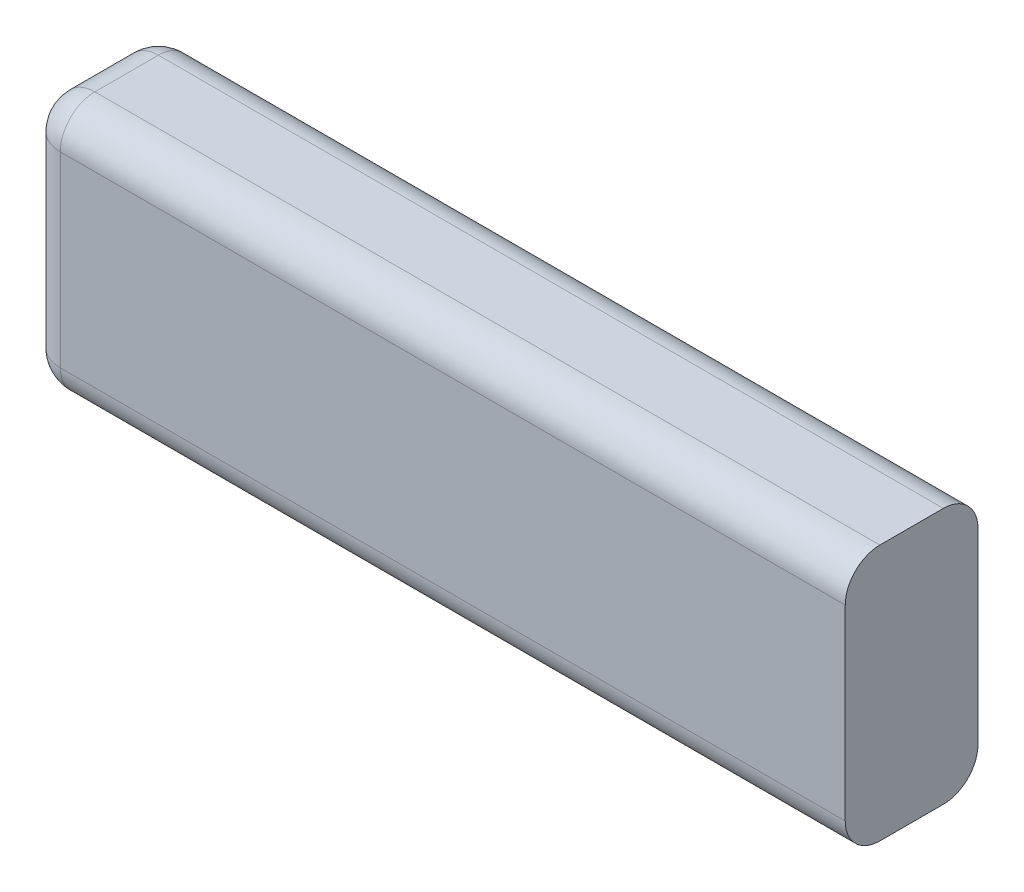
ISO-10303-21;
HEADER;
FILE_DESCRIPTION(('STEP AP214'),'2;1');
FILE_NAME('part.step','',(''),(''),'','','');
FILE_SCHEMA(('AUTOMOTIVE_DESIGN { 1 0 10303 214 1 1 1 1 }'));
ENDSEC;
DATA;
#1=APPLICATION_CONTEXT('core data for automotive mechanical design processes');
#2=APPLICATION_PROTOCOL_DEFINITION('international standard','automotive_design',2000,#1);
#3=PRODUCT_CONTEXT('',#1,'mechanical');
#4=PRODUCT('Part','Part','',(#3));
#5=PRODUCT_RELATED_PRODUCT_CATEGORY('part','',(#4));
#6=PRODUCT_DEFINITION_FORMATION('','',#4);
#7=PRODUCT_DEFINITION_CONTEXT('part definition',#1,'design');
#8=PRODUCT_DEFINITION('design','',#6,#7);
#9=PRODUCT_DEFINITION_SHAPE('','',#8);
#10=(LENGTH_UNIT() NAMED_UNIT(*) SI_UNIT(.MILLI.,.METRE.));
#11=(NAMED_UNIT(*) PLANE_ANGLE_UNIT() SI_UNIT($,.RADIAN.));
#12=(NAMED_UNIT(*) SI_UNIT($,.STERADIAN.) SOLID_ANGLE_UNIT());
#13=UNCERTAINTY_MEASURE_WITH_UNIT(LENGTH_MEASURE(1.E-05),#10,'distance_accuracy_value','');
#14=(GEOMETRIC_REPRESENTATION_CONTEXT(3) GLOBAL_UNCERTAINTY_ASSIGNED_CONTEXT((#13)) GLOBAL_UNIT_ASSIGNED_CONTEXT((#10,
#11,#12)) REPRESENTATION_CONTEXT('',''));
#15=CARTESIAN_POINT('',(0.,0.,0.));
#16=DIRECTION('',(0.,0.,1.));
#17=DIRECTION('',(1.,0.,0.));
#18=AXIS2_PLACEMENT_3D('',#15,#16,#17);
#19=CARTESIAN_POINT('',(0.,0.,5.75));
#20=DIRECTION('',(1.,0.,0.));
#21=DIRECTION('',(0.,0.,-1.));
#22=AXIS2_PLACEMENT_3D('',#19,#20,#21);
#23=PLANE('',#22);
#24=DIRECTION('',(0.,-1.,0.));
#25=VECTOR('',#24,1.);
#26=CARTESIAN_POINT('',(0.,0.,1.5));
#27=LINE('',#26,#25);
#28=CARTESIAN_POINT('',(0.,9.6,1.5));
#29=VERTEX_POINT('',#28);
#30=CARTESIAN_POINT('',(0.,1.5,1.5));
#31=VERTEX_POINT('',#30);
#32=EDGE_CURVE('E161',#29,#31,#27,.T.);
#33=ORIENTED_EDGE('',*,*,#32,.T.);
#34=DIRECTION('',(0.,0.,-1.));
#35=VECTOR('',#34,1.);
#36=CARTESIAN_POINT('',(0.,1.5,5.75));
#37=LINE('',#36,#35);
#38=CARTESIAN_POINT('',(0.,1.5,4.25));
#39=VERTEX_POINT('',#38);
#40=EDGE_CURVE('E163',#31,#39,#37,.F.);
#41=ORIENTED_EDGE('',*,*,#40,.T.);
#42=DIRECTION('',(0.,-1.,0.));
#43=VECTOR('',#42,1.);
#44=CARTESIAN_POINT('',(0.,0.,4.25));
#45=LINE('',#44,#43);
#46=CARTESIAN_POINT('',(0.,9.6,4.25));
#47=VERTEX_POINT('',#46);
#48=EDGE_CURVE('E159',#39,#47,#45,.F.);
#49=ORIENTED_EDGE('',*,*,#48,.T.);
#50=DIRECTION('',(0.,0.,-1.));
#51=VECTOR('',#50,1.);
#52=CARTESIAN_POINT('',(0.,9.6,5.75));
#53=LINE('',#52,#51);
#54=EDGE_CURVE('E157',#47,#29,#53,.T.);
#55=ORIENTED_EDGE('',*,*,#54,.T.);
#56=EDGE_LOOP('',(#33,#41,#49,#55));
#57=FACE_BOUND('',#56,.T.);
#58=ADVANCED_FACE('F34',(#57),#23,.F.);
#59=CARTESIAN_POINT('',(0.,0.,5.75));
#60=DIRECTION('',(0.,1.,0.));
#61=DIRECTION('',(0.,0.,1.));
#62=AXIS2_PLACEMENT_3D('',#59,#60,#61);
#63=PLANE('',#62);
#64=DIRECTION('',(0.,0.,-1.));
#65=VECTOR('',#64,1.);
#66=CARTESIAN_POINT('',(1.5,0.,5.75));
#67=LINE('',#66,#65);
#68=CARTESIAN_POINT('',(1.5,0.,4.25));
#69=VERTEX_POINT('',#68);
#70=CARTESIAN_POINT('',(1.5,0.,1.5));
#71=VERTEX_POINT('',#70);
#72=EDGE_CURVE('E130',#69,#71,#67,.T.);
#73=ORIENTED_EDGE('',*,*,#72,.T.);
#74=DIRECTION('',(1.,0.,0.));
#75=VECTOR('',#74,1.);
#76=CARTESIAN_POINT('',(35.5,0.,1.5));
#77=LINE('',#76,#75);
#78=CARTESIAN_POINT('',(35.5,0.,1.5));
#79=VERTEX_POINT('',#78);
#80=EDGE_CURVE('E129',#71,#79,#77,.T.);
#81=ORIENTED_EDGE('',*,*,#80,.T.);
#82=DIRECTION('',(0.,0.,-1.));
#83=VECTOR('',#82,1.);
#84=CARTESIAN_POINT('',(35.5,0.,5.75));
#85=LINE('',#84,#83);
#86=CARTESIAN_POINT('',(35.5,0.,4.25));
#87=VERTEX_POINT('',#86);
#88=EDGE_CURVE('E114',#87,#79,#85,.T.);
#89=ORIENTED_EDGE('',*,*,#88,.F.);
#90=DIRECTION('',(1.,0.,0.));
#91=VECTOR('',#90,1.);
#92=CARTESIAN_POINT('',(0.,0.,4.25));
#93=LINE('',#92,#91);
#94=EDGE_CURVE('E126',#87,#69,#93,.F.);
#95=ORIENTED_EDGE('',*,*,#94,.T.);
#96=EDGE_LOOP('',(#73,#81,#89,#95));
#97=FACE_BOUND('',#96,.T.);
#98=ADVANCED_FACE('F125',(#97),#63,.F.);
#99=CARTESIAN_POINT('',(35.5,0.,5.75));
#100=DIRECTION('',(-1.,0.,0.));
#101=DIRECTION('',(0.,0.,1.));
#102=AXIS2_PLACEMENT_3D('',#99,#100,#101);
#103=PLANE('',#102);
#104=ORIENTED_EDGE('',*,*,#88,.T.);
#105=CARTESIAN_POINT('',(35.5,1.5,1.5));
#106=DIRECTION('',(-1.,0.,0.));
#107=DIRECTION('',(0.,0.,1.));
#108=AXIS2_PLACEMENT_3D('',#105,#106,#107);
#109=CIRCLE('',#108,1.5);
#110=CARTESIAN_POINT('',(35.5,1.5,0.));
#111=VERTEX_POINT('',#110);
#112=EDGE_CURVE('E120',#79,#111,#109,.F.);
#113=ORIENTED_EDGE('',*,*,#112,.T.);
#114=DIRECTION('',(0.,1.,0.));
#115=VECTOR('',#114,1.);
#116=CARTESIAN_POINT('',(35.5,0.,0.));
#117=LINE('',#116,#115);
#118=CARTESIAN_POINT('',(35.5,9.6,0.));
#119=VERTEX_POINT('',#118);
#120=EDGE_CURVE('E200',#111,#119,#117,.T.);
#121=ORIENTED_EDGE('',*,*,#120,.T.);
#122=CARTESIAN_POINT('',(35.5,9.6,1.5));
#123=DIRECTION('',(-1.,0.,0.));
#124=DIRECTION('',(0.,0.,1.));
#125=AXIS2_PLACEMENT_3D('',#122,#123,#124);
#126=CIRCLE('',#125,1.5);
#127=CARTESIAN_POINT('',(35.5,11.1,1.5));
#128=VERTEX_POINT('',#127);
#129=EDGE_CURVE('E121',#119,#128,#126,.F.);
#130=ORIENTED_EDGE('',*,*,#129,.T.);
#131=DIRECTION('',(0.,0.,-1.));
#132=VECTOR('',#131,1.);
#133=CARTESIAN_POINT('',(35.5,11.1,5.75));
#134=LINE('',#133,#132);
#135=CARTESIAN_POINT('',(35.5,11.1,4.25));
#136=VERTEX_POINT('',#135);
#137=EDGE_CURVE('E131',#136,#128,#134,.T.);
#138=ORIENTED_EDGE('',*,*,#137,.F.);
#139=CARTESIAN_POINT('',(35.5,9.6,4.25));
#140=DIRECTION('',(-1.,0.,0.));
#141=DIRECTION('',(0.,0.,1.));
#142=AXIS2_PLACEMENT_3D('',#139,#140,#141);
#143=CIRCLE('',#142,1.5);
#144=CARTESIAN_POINT('',(35.5,9.6,5.75));
#145=VERTEX_POINT('',#144);
#146=EDGE_CURVE('E138',#136,#145,#143,.F.);
#147=ORIENTED_EDGE('',*,*,#146,.T.);
#148=DIRECTION('',(0.,1.,0.));
#149=VECTOR('',#148,1.);
#150=CARTESIAN_POINT('',(35.5,0.,5.75));
#151=LINE('',#150,#149);
#152=CARTESIAN_POINT('',(35.5,1.5,5.75));
#153=VERTEX_POINT('',#152);
#154=EDGE_CURVE('E116',#153,#145,#151,.T.);
#155=ORIENTED_EDGE('',*,*,#154,.F.);
#156=CARTESIAN_POINT('',(35.5,1.5,4.25));
#157=DIRECTION('',(-1.,0.,0.));
#158=DIRECTION('',(0.,0.,1.));
#159=AXIS2_PLACEMENT_3D('',#156,#157,#158);
#160=CIRCLE('',#159,1.5);
#161=EDGE_CURVE('E111',#153,#87,#160,.F.);
#162=ORIENTED_EDGE('',*,*,#161,.T.);
#163=EDGE_LOOP('',(#104,#113,#121,#130,#138,#147,#155,#162));
#164=FACE_BOUND('',#163,.T.);
#165=ADVANCED_FACE('F113',(#164),#103,.F.);
#166=CARTESIAN_POINT('',(0.,11.1,5.75));
#167=DIRECTION('',(0.,-1.,0.));
#168=DIRECTION('',(0.,0.,-1.));
#169=AXIS2_PLACEMENT_3D('',#166,#167,#168);
#170=PLANE('',#169);
#171=ORIENTED_EDGE('',*,*,#137,.T.);
#172=DIRECTION('',(-1.,0.,0.));
#173=VECTOR('',#172,1.);
#174=CARTESIAN_POINT('',(0.,11.1,1.5));
#175=LINE('',#174,#173);
#176=CARTESIAN_POINT('',(1.5,11.1,1.5));
#177=VERTEX_POINT('',#176);
#178=EDGE_CURVE('E11',#128,#177,#175,.T.);
#179=ORIENTED_EDGE('',*,*,#178,.T.);
#180=DIRECTION('',(0.,0.,-1.));
#181=VECTOR('',#180,1.);
#182=CARTESIAN_POINT('',(1.5,11.1,5.75));
#183=LINE('',#182,#181);
#184=CARTESIAN_POINT('',(1.5,11.1,4.25));
#185=VERTEX_POINT('',#184);
#186=EDGE_CURVE('E50',#177,#185,#183,.F.);
#187=ORIENTED_EDGE('',*,*,#186,.T.);
#188=DIRECTION('',(-1.,0.,0.));
#189=VECTOR('',#188,1.);
#190=CARTESIAN_POINT('',(0.,11.1,4.25));
#191=LINE('',#190,#189);
#192=EDGE_CURVE('E43',#185,#136,#191,.F.);
#193=ORIENTED_EDGE('',*,*,#192,.T.);
#194=EDGE_LOOP('',(#171,#179,#187,#193));
#195=FACE_BOUND('',#194,.T.);
#196=ADVANCED_FACE('F211',(#195),#170,.F.);
#197=CARTESIAN_POINT('',(0.,0.,5.75));
#198=DIRECTION('',(0.,0.,-1.));
#199=DIRECTION('',(-1.,0.,0.));
#200=AXIS2_PLACEMENT_3D('',#197,#198,#199);
#201=PLANE('',#200);
#202=DIRECTION('',(0.,-1.,0.));
#203=VECTOR('',#202,1.);
#204=CARTESIAN_POINT('',(1.5,0.,5.75));
#205=LINE('',#204,#203);
#206=CARTESIAN_POINT('',(1.5,9.6,5.75));
#207=VERTEX_POINT('',#206);
#208=CARTESIAN_POINT('',(1.5,1.5,5.75));
#209=VERTEX_POINT('',#208);
#210=EDGE_CURVE('E153',#207,#209,#205,.T.);
#211=ORIENTED_EDGE('',*,*,#210,.T.);
#212=DIRECTION('',(1.,0.,0.));
#213=VECTOR('',#212,1.);
#214=CARTESIAN_POINT('',(0.,1.5,5.75));
#215=LINE('',#214,#213);
#216=EDGE_CURVE('E155',#209,#153,#215,.T.);
#217=ORIENTED_EDGE('',*,*,#216,.T.);
#218=ORIENTED_EDGE('',*,*,#154,.T.);
#219=DIRECTION('',(-1.,0.,0.));
#220=VECTOR('',#219,1.);
#221=CARTESIAN_POINT('',(0.,9.6,5.75));
#222=LINE('',#221,#220);
#223=EDGE_CURVE('E151',#145,#207,#222,.T.);
#224=ORIENTED_EDGE('',*,*,#223,.T.);
#225=EDGE_LOOP('',(#211,#217,#218,#224));
#226=FACE_BOUND('',#225,.T.);
#227=ADVANCED_FACE('F349',(#226),#201,.F.);
#228=CARTESIAN_POINT('',(0.,0.,0.));
#229=DIRECTION('',(0.,0.,-1.));
#230=DIRECTION('',(-1.,0.,0.));
#231=AXIS2_PLACEMENT_3D('',#228,#229,#230);
#232=PLANE('',#231);
#233=ORIENTED_EDGE('',*,*,#120,.F.);
#234=DIRECTION('',(1.,0.,0.));
#235=VECTOR('',#234,1.);
#236=CARTESIAN_POINT('',(0.,1.5,0.));
#237=LINE('',#236,#235);
#238=CARTESIAN_POINT('',(1.5,1.5,0.));
#239=VERTEX_POINT('',#238);
#240=EDGE_CURVE('E149',#111,#239,#237,.F.);
#241=ORIENTED_EDGE('',*,*,#240,.T.);
#242=DIRECTION('',(0.,-1.,0.));
#243=VECTOR('',#242,1.);
#244=CARTESIAN_POINT('',(1.5,11.1,0.));
#245=LINE('',#244,#243);
#246=CARTESIAN_POINT('',(1.5,9.6,0.));
#247=VERTEX_POINT('',#246);
#248=EDGE_CURVE('E147',#239,#247,#245,.F.);
#249=ORIENTED_EDGE('',*,*,#248,.T.);
#250=DIRECTION('',(-1.,0.,0.));
#251=VECTOR('',#250,1.);
#252=CARTESIAN_POINT('',(35.5,9.6,0.));
#253=LINE('',#252,#251);
#254=EDGE_CURVE('E145',#247,#119,#253,.F.);
#255=ORIENTED_EDGE('',*,*,#254,.T.);
#256=EDGE_LOOP('',(#233,#241,#249,#255));
#257=FACE_BOUND('',#256,.T.);
#258=ADVANCED_FACE('F237',(#257),#232,.T.);
#259=CARTESIAN_POINT('',(0.,9.6,4.25));
#260=DIRECTION('',(-1.,0.,0.));
#261=DIRECTION('',(0.,0.,1.));
#262=AXIS2_PLACEMENT_3D('',#259,#260,#261);
#263=CYLINDRICAL_SURFACE('',#262,1.5);
#264=CARTESIAN_POINT('',(1.5,9.6,4.25));
#265=DIRECTION('',(-1.,0.,0.));
#266=DIRECTION('',(0.,0.,1.));
#267=AXIS2_PLACEMENT_3D('',#264,#265,#266);
#268=CIRCLE('',#267,1.5);
#269=EDGE_CURVE('E38',#207,#185,#268,.T.);
#270=ORIENTED_EDGE('',*,*,#269,.F.);
#271=ORIENTED_EDGE('',*,*,#223,.F.);
#272=ORIENTED_EDGE('',*,*,#146,.F.);
#273=ORIENTED_EDGE('',*,*,#192,.F.);
#274=EDGE_LOOP('',(#270,#271,#272,#273));
#275=FACE_BOUND('',#274,.T.);
#276=ADVANCED_FACE('F36',(#275),#263,.T.);
#277=CARTESIAN_POINT('',(1.5,9.6,4.25));
#278=DIRECTION('',(0.,0.,1.));
#279=DIRECTION('',(1.,0.,0.));
#280=AXIS2_PLACEMENT_3D('',#277,#278,#279);
#281=SPHERICAL_SURFACE('',#280,1.5);
#282=CARTESIAN_POINT('',(1.5,9.6,4.25));
#283=DIRECTION('',(0.,1.,0.));
#284=DIRECTION('',(0.,0.,1.));
#285=AXIS2_PLACEMENT_3D('',#282,#283,#284);
#286=CIRCLE('',#285,1.5);
#287=EDGE_CURVE('E192',#207,#47,#286,.F.);
#288=ORIENTED_EDGE('',*,*,#287,.F.);
#289=ORIENTED_EDGE('',*,*,#269,.T.);
#290=CARTESIAN_POINT('',(1.5,9.6,4.25));
#291=DIRECTION('',(0.,0.,1.));
#292=DIRECTION('',(1.,0.,0.));
#293=AXIS2_PLACEMENT_3D('',#290,#291,#292);
#294=CIRCLE('',#293,1.5);
#295=EDGE_CURVE('E194',#47,#185,#294,.F.);
#296=ORIENTED_EDGE('',*,*,#295,.F.);
#297=EDGE_LOOP('',(#288,#289,#296));
#298=FACE_BOUND('',#297,.T.);
#299=ADVANCED_FACE('F230',(#298),#281,.T.);
#300=CARTESIAN_POINT('',(0.,9.6,1.5));
#301=DIRECTION('',(1.,0.,0.));
#302=DIRECTION('',(0.,0.,-1.));
#303=AXIS2_PLACEMENT_3D('',#300,#301,#302);
#304=CYLINDRICAL_SURFACE('',#303,1.5);
#305=ORIENTED_EDGE('',*,*,#129,.F.);
#306=ORIENTED_EDGE('',*,*,#254,.F.);
#307=CARTESIAN_POINT('',(1.5,9.6,1.5));
#308=DIRECTION('',(-1.,0.,0.));
#309=DIRECTION('',(0.,0.,1.));
#310=AXIS2_PLACEMENT_3D('',#307,#308,#309);
#311=CIRCLE('',#310,1.5);
#312=EDGE_CURVE('E189',#177,#247,#311,.T.);
#313=ORIENTED_EDGE('',*,*,#312,.F.);
#314=ORIENTED_EDGE('',*,*,#178,.F.);
#315=EDGE_LOOP('',(#305,#306,#313,#314));
#316=FACE_BOUND('',#315,.T.);
#317=ADVANCED_FACE('F215',(#316),#304,.T.);
#318=CARTESIAN_POINT('',(1.5,9.6,5.75));
#319=DIRECTION('',(0.,0.,-1.));
#320=DIRECTION('',(-1.,0.,0.));
#321=AXIS2_PLACEMENT_3D('',#318,#319,#320);
#322=CYLINDRICAL_SURFACE('',#321,1.5);
#323=ORIENTED_EDGE('',*,*,#295,.T.);
#324=ORIENTED_EDGE('',*,*,#186,.F.);
#325=CARTESIAN_POINT('',(1.5,9.6,1.5));
#326=DIRECTION('',(0.,0.,-1.));
#327=DIRECTION('',(-1.,0.,0.));
#328=AXIS2_PLACEMENT_3D('',#325,#326,#327);
#329=CIRCLE('',#328,1.5);
#330=EDGE_CURVE('E186',#29,#177,#329,.T.);
#331=ORIENTED_EDGE('',*,*,#330,.F.);
#332=ORIENTED_EDGE('',*,*,#54,.F.);
#333=EDGE_LOOP('',(#323,#324,#331,#332));
#334=FACE_BOUND('',#333,.T.);
#335=ADVANCED_FACE('F222',(#334),#322,.T.);
#336=CARTESIAN_POINT('',(1.5,0.,4.25));
#337=DIRECTION('',(0.,-1.,0.));
#338=DIRECTION('',(0.,0.,-1.));
#339=AXIS2_PLACEMENT_3D('',#336,#337,#338);
#340=CYLINDRICAL_SURFACE('',#339,1.5);
#341=ORIENTED_EDGE('',*,*,#287,.T.);
#342=ORIENTED_EDGE('',*,*,#48,.F.);
#343=CARTESIAN_POINT('',(1.5,1.5,4.25));
#344=DIRECTION('',(0.,-1.,0.));
#345=DIRECTION('',(0.,0.,-1.));
#346=AXIS2_PLACEMENT_3D('',#343,#344,#345);
#347=CIRCLE('',#346,1.5);
#348=EDGE_CURVE('E183',#209,#39,#347,.T.);
#349=ORIENTED_EDGE('',*,*,#348,.F.);
#350=ORIENTED_EDGE('',*,*,#210,.F.);
#351=EDGE_LOOP('',(#341,#342,#349,#350));
#352=FACE_BOUND('',#351,.T.);
#353=ADVANCED_FACE('F229',(#352),#340,.T.);
#354=CARTESIAN_POINT('',(0.,1.5,4.25));
#355=DIRECTION('',(1.,0.,0.));
#356=DIRECTION('',(0.,0.,-1.));
#357=AXIS2_PLACEMENT_3D('',#354,#355,#356);
#358=CYLINDRICAL_SURFACE('',#357,1.5);
#359=ORIENTED_EDGE('',*,*,#161,.F.);
#360=ORIENTED_EDGE('',*,*,#216,.F.);
#361=CARTESIAN_POINT('',(1.5,1.5,4.25));
#362=DIRECTION('',(-1.,0.,0.));
#363=DIRECTION('',(0.,0.,1.));
#364=AXIS2_PLACEMENT_3D('',#361,#362,#363);
#365=CIRCLE('',#364,1.5);
#366=EDGE_CURVE('E135',#69,#209,#365,.T.);
#367=ORIENTED_EDGE('',*,*,#366,.F.);
#368=ORIENTED_EDGE('',*,*,#94,.F.);
#369=EDGE_LOOP('',(#359,#360,#367,#368));
#370=FACE_BOUND('',#369,.T.);
#371=ADVANCED_FACE('F133',(#370),#358,.T.);
#372=CARTESIAN_POINT('',(1.5,9.6,1.5));
#373=DIRECTION('',(0.,0.,1.));
#374=DIRECTION('',(1.,0.,0.));
#375=AXIS2_PLACEMENT_3D('',#372,#373,#374);
#376=SPHERICAL_SURFACE('',#375,1.5);
#377=ORIENTED_EDGE('',*,*,#330,.T.);
#378=ORIENTED_EDGE('',*,*,#312,.T.);
#379=CARTESIAN_POINT('',(1.5,9.6,1.5));
#380=DIRECTION('',(0.,1.,0.));
#381=DIRECTION('',(0.,0.,1.));
#382=AXIS2_PLACEMENT_3D('',#379,#380,#381);
#383=CIRCLE('',#382,1.5);
#384=EDGE_CURVE('E179',#29,#247,#383,.F.);
#385=ORIENTED_EDGE('',*,*,#384,.F.);
#386=EDGE_LOOP('',(#377,#378,#385));
#387=FACE_BOUND('',#386,.T.);
#388=ADVANCED_FACE('F220',(#387),#376,.T.);
#389=CARTESIAN_POINT('',(1.5,1.5,4.25));
#390=DIRECTION('',(0.,0.,1.));
#391=DIRECTION('',(1.,0.,0.));
#392=AXIS2_PLACEMENT_3D('',#389,#390,#391);
#393=SPHERICAL_SURFACE('',#392,1.5);
#394=ORIENTED_EDGE('',*,*,#366,.T.);
#395=ORIENTED_EDGE('',*,*,#348,.T.);
#396=CARTESIAN_POINT('',(1.5,1.5,4.25));
#397=DIRECTION('',(0.,0.,1.));
#398=DIRECTION('',(1.,0.,0.));
#399=AXIS2_PLACEMENT_3D('',#396,#397,#398);
#400=CIRCLE('',#399,1.5);
#401=EDGE_CURVE('E177',#69,#39,#400,.F.);
#402=ORIENTED_EDGE('',*,*,#401,.F.);
#403=EDGE_LOOP('',(#394,#395,#402));
#404=FACE_BOUND('',#403,.T.);
#405=ADVANCED_FACE('F262',(#404),#393,.T.);
#406=CARTESIAN_POINT('',(1.5,0.,1.5));
#407=DIRECTION('',(0.,1.,0.));
#408=DIRECTION('',(0.,0.,1.));
#409=AXIS2_PLACEMENT_3D('',#406,#407,#408);
#410=CYLINDRICAL_SURFACE('',#409,1.5);
#411=ORIENTED_EDGE('',*,*,#384,.T.);
#412=ORIENTED_EDGE('',*,*,#248,.F.);
#413=CARTESIAN_POINT('',(1.5,1.5,1.5));
#414=DIRECTION('',(0.,-1.,0.));
#415=DIRECTION('',(0.,0.,-1.));
#416=AXIS2_PLACEMENT_3D('',#413,#414,#415);
#417=CIRCLE('',#416,1.5);
#418=EDGE_CURVE('E174',#31,#239,#417,.T.);
#419=ORIENTED_EDGE('',*,*,#418,.F.);
#420=ORIENTED_EDGE('',*,*,#32,.F.);
#421=EDGE_LOOP('',(#411,#412,#419,#420));
#422=FACE_BOUND('',#421,.T.);
#423=ADVANCED_FACE('F258',(#422),#410,.T.);
#424=CARTESIAN_POINT('',(1.5,1.5,5.75));
#425=DIRECTION('',(0.,0.,-1.));
#426=DIRECTION('',(-1.,0.,0.));
#427=AXIS2_PLACEMENT_3D('',#424,#425,#426);
#428=CYLINDRICAL_SURFACE('',#427,1.5);
#429=ORIENTED_EDGE('',*,*,#401,.T.);
#430=ORIENTED_EDGE('',*,*,#40,.F.);
#431=CARTESIAN_POINT('',(1.5,1.5,1.5));
#432=DIRECTION('',(0.,0.,-1.));
#433=DIRECTION('',(-1.,0.,0.));
#434=AXIS2_PLACEMENT_3D('',#431,#432,#433);
#435=CIRCLE('',#434,1.5);
#436=EDGE_CURVE('E171',#71,#31,#435,.T.);
#437=ORIENTED_EDGE('',*,*,#436,.F.);
#438=ORIENTED_EDGE('',*,*,#72,.F.);
#439=EDGE_LOOP('',(#429,#430,#437,#438));
#440=FACE_BOUND('',#439,.T.);
#441=ADVANCED_FACE('F254',(#440),#428,.T.);
#442=CARTESIAN_POINT('',(1.5,1.5,1.5));
#443=DIRECTION('',(0.,0.,1.));
#444=DIRECTION('',(1.,0.,0.));
#445=AXIS2_PLACEMENT_3D('',#442,#443,#444);
#446=SPHERICAL_SURFACE('',#445,1.5);
#447=ORIENTED_EDGE('',*,*,#436,.T.);
#448=ORIENTED_EDGE('',*,*,#418,.T.);
#449=CARTESIAN_POINT('',(1.5,1.5,1.5));
#450=DIRECTION('',(-1.,0.,0.));
#451=DIRECTION('',(0.,0.,1.));
#452=AXIS2_PLACEMENT_3D('',#449,#450,#451);
#453=CIRCLE('',#452,1.5);
#454=EDGE_CURVE('E168',#71,#239,#453,.F.);
#455=ORIENTED_EDGE('',*,*,#454,.F.);
#456=EDGE_LOOP('',(#447,#448,#455));
#457=FACE_BOUND('',#456,.T.);
#458=ADVANCED_FACE('F250',(#457),#446,.T.);
#459=CARTESIAN_POINT('',(0.,1.5,1.5));
#460=DIRECTION('',(-1.,0.,0.));
#461=DIRECTION('',(0.,0.,1.));
#462=AXIS2_PLACEMENT_3D('',#459,#460,#461);
#463=CYLINDRICAL_SURFACE('',#462,1.5);
#464=ORIENTED_EDGE('',*,*,#454,.T.);
#465=ORIENTED_EDGE('',*,*,#240,.F.);
#466=ORIENTED_EDGE('',*,*,#112,.F.);
#467=ORIENTED_EDGE('',*,*,#80,.F.);
#468=EDGE_LOOP('',(#464,#465,#466,#467));
#469=FACE_BOUND('',#468,.T.);
#470=ADVANCED_FACE('F247',(#469),#463,.T.);
#471=CLOSED_SHELL('',(#58,#98,#165,#196,#227,#258,#276,#299,#317,#335,#353,#371,#388,#405,#423,
#441,#458,#470));
#472=MANIFOLD_SOLID_BREP('B2',#471);
#473=ADVANCED_BREP_SHAPE_REPRESENTATION('',(#18,#472),#14);
#474=SHAPE_DEFINITION_REPRESENTATION(#9,#473);
ENDSEC;
END-ISO-10303-21;
